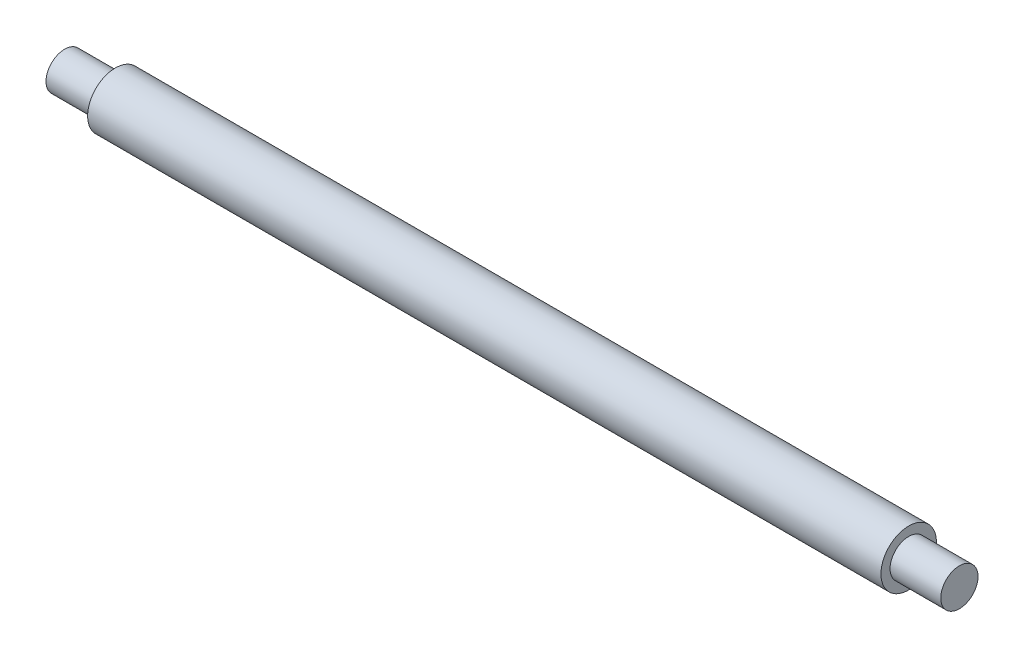
ISO-10303-21;
HEADER;
FILE_DESCRIPTION(('STEP AP214'),'2;1');
FILE_NAME('part.step','',(''),(''),'','','');
FILE_SCHEMA(('AUTOMOTIVE_DESIGN { 1 0 10303 214 1 1 1 1 }'));
ENDSEC;
DATA;
#1=APPLICATION_CONTEXT('core data for automotive mechanical design processes');
#2=APPLICATION_PROTOCOL_DEFINITION('international standard','automotive_design',2000,#1);
#3=PRODUCT_CONTEXT('',#1,'mechanical');
#4=PRODUCT('Part','Part','',(#3));
#5=PRODUCT_RELATED_PRODUCT_CATEGORY('part','',(#4));
#6=PRODUCT_DEFINITION_FORMATION('','',#4);
#7=PRODUCT_DEFINITION_CONTEXT('part definition',#1,'design');
#8=PRODUCT_DEFINITION('design','',#6,#7);
#9=PRODUCT_DEFINITION_SHAPE('','',#8);
#10=(LENGTH_UNIT() NAMED_UNIT(*) SI_UNIT(.MILLI.,.METRE.));
#11=(NAMED_UNIT(*) PLANE_ANGLE_UNIT() SI_UNIT($,.RADIAN.));
#12=(NAMED_UNIT(*) SI_UNIT($,.STERADIAN.) SOLID_ANGLE_UNIT());
#13=UNCERTAINTY_MEASURE_WITH_UNIT(LENGTH_MEASURE(1.E-05),#10,'distance_accuracy_value','');
#14=(GEOMETRIC_REPRESENTATION_CONTEXT(3) GLOBAL_UNCERTAINTY_ASSIGNED_CONTEXT((#13)) GLOBAL_UNIT_ASSIGNED_CONTEXT((#10,
#11,#12)) REPRESENTATION_CONTEXT('',''));
#15=CARTESIAN_POINT('',(0.,0.,0.));
#16=DIRECTION('',(0.,0.,1.));
#17=DIRECTION('',(1.,0.,0.));
#18=AXIS2_PLACEMENT_3D('',#15,#16,#17);
#19=CARTESIAN_POINT('',(76.2,0.,0.));
#20=DIRECTION('',(-1.,0.,0.));
#21=DIRECTION('',(0.,0.,1.));
#22=AXIS2_PLACEMENT_3D('',#19,#20,#21);
#23=PLANE('',#22);
#24=CARTESIAN_POINT('',(76.2,0.,0.));
#25=DIRECTION('',(-1.,0.,0.));
#26=DIRECTION('',(0.,0.,1.));
#27=AXIS2_PLACEMENT_3D('',#24,#25,#26);
#28=CIRCLE('',#27,3.17500000000001);
#29=CARTESIAN_POINT('',(76.2,0.,3.17500000000001));
#30=VERTEX_POINT('',#29);
#31=EDGE_CURVE('E12',#30,#30,#28,.T.);
#32=ORIENTED_EDGE('',*,*,#31,.F.);
#33=EDGE_LOOP('',(#32));
#34=FACE_BOUND('',#33,.T.);
#35=ADVANCED_FACE('F44',(#34),#23,.F.);
#36=CARTESIAN_POINT('',(-76.2,0.,0.));
#37=DIRECTION('',(-1.,0.,0.));
#38=DIRECTION('',(0.,0.,1.));
#39=AXIS2_PLACEMENT_3D('',#36,#37,#38);
#40=CYLINDRICAL_SURFACE('',#39,3.175);
#41=CARTESIAN_POINT('',(67.564,0.,0.));
#42=DIRECTION('',(-1.,0.,0.));
#43=DIRECTION('',(0.,0.,1.));
#44=AXIS2_PLACEMENT_3D('',#41,#42,#43);
#45=CIRCLE('',#44,3.175);
#46=CARTESIAN_POINT('',(67.564,0.,3.175));
#47=VERTEX_POINT('',#46);
#48=EDGE_CURVE('E50',#47,#47,#45,.T.);
#49=ORIENTED_EDGE('',*,*,#48,.F.);
#50=EDGE_LOOP('',(#49));
#51=FACE_BOUND('',#50,.T.);
#52=ORIENTED_EDGE('',*,*,#31,.T.);
#53=EDGE_LOOP('',(#52));
#54=FACE_BOUND('',#53,.T.);
#55=ADVANCED_FACE('F92',(#51,#54),#40,.T.);
#56=CARTESIAN_POINT('',(67.564,3.175,0.));
#57=DIRECTION('',(-1.,0.,0.));
#58=DIRECTION('',(0.,0.,1.));
#59=AXIS2_PLACEMENT_3D('',#56,#57,#58);
#60=PLANE('',#59);
#61=CARTESIAN_POINT('',(67.564,0.,0.));
#62=DIRECTION('',(-1.,0.,0.));
#63=DIRECTION('',(0.,0.,1.));
#64=AXIS2_PLACEMENT_3D('',#61,#62,#63);
#65=CIRCLE('',#64,4.72439999999999);
#66=CARTESIAN_POINT('',(67.564,0.,4.72439999999999));
#67=VERTEX_POINT('',#66);
#68=EDGE_CURVE('E54',#67,#67,#65,.T.);
#69=ORIENTED_EDGE('',*,*,#68,.F.);
#70=EDGE_LOOP('',(#69));
#71=FACE_BOUND('',#70,.T.);
#72=ORIENTED_EDGE('',*,*,#48,.T.);
#73=EDGE_LOOP('',(#72));
#74=FACE_BOUND('',#73,.T.);
#75=ADVANCED_FACE('F87',(#71,#74),#60,.F.);
#76=CARTESIAN_POINT('',(-76.2,0.,0.));
#77=DIRECTION('',(-1.,0.,0.));
#78=DIRECTION('',(0.,0.,1.));
#79=AXIS2_PLACEMENT_3D('',#76,#77,#78);
#80=CYLINDRICAL_SURFACE('',#79,4.72439999999999);
#81=CARTESIAN_POINT('',(-67.564,0.,0.));
#82=DIRECTION('',(-1.,0.,0.));
#83=DIRECTION('',(0.,0.,1.));
#84=AXIS2_PLACEMENT_3D('',#81,#82,#83);
#85=CIRCLE('',#84,4.72439999999999);
#86=CARTESIAN_POINT('',(-67.564,0.,4.72439999999999));
#87=VERTEX_POINT('',#86);
#88=EDGE_CURVE('E58',#87,#87,#85,.T.);
#89=ORIENTED_EDGE('',*,*,#88,.F.);
#90=EDGE_LOOP('',(#89));
#91=FACE_BOUND('',#90,.T.);
#92=ORIENTED_EDGE('',*,*,#68,.T.);
#93=EDGE_LOOP('',(#92));
#94=FACE_BOUND('',#93,.T.);
#95=ADVANCED_FACE('F81',(#91,#94),#80,.T.);
#96=CARTESIAN_POINT('',(-67.564,3.175,0.));
#97=DIRECTION('',(1.,0.,0.));
#98=DIRECTION('',(0.,0.,-1.));
#99=AXIS2_PLACEMENT_3D('',#96,#97,#98);
#100=PLANE('',#99);
#101=CARTESIAN_POINT('',(-67.564,0.,0.));
#102=DIRECTION('',(-1.,0.,0.));
#103=DIRECTION('',(0.,0.,1.));
#104=AXIS2_PLACEMENT_3D('',#101,#102,#103);
#105=CIRCLE('',#104,3.175);
#106=CARTESIAN_POINT('',(-67.564,0.,3.175));
#107=VERTEX_POINT('',#106);
#108=EDGE_CURVE('E63',#107,#107,#105,.T.);
#109=ORIENTED_EDGE('',*,*,#108,.F.);
#110=EDGE_LOOP('',(#109));
#111=FACE_BOUND('',#110,.T.);
#112=ORIENTED_EDGE('',*,*,#88,.T.);
#113=EDGE_LOOP('',(#112));
#114=FACE_BOUND('',#113,.T.);
#115=ADVANCED_FACE('F75',(#111,#114),#100,.F.);
#116=CARTESIAN_POINT('',(-76.2,0.,0.));
#117=DIRECTION('',(-1.,0.,0.));
#118=DIRECTION('',(0.,0.,1.));
#119=AXIS2_PLACEMENT_3D('',#116,#117,#118);
#120=CYLINDRICAL_SURFACE('',#119,3.175);
#121=CARTESIAN_POINT('',(-76.2,0.,0.));
#122=DIRECTION('',(-1.,0.,0.));
#123=DIRECTION('',(0.,0.,1.));
#124=AXIS2_PLACEMENT_3D('',#121,#122,#123);
#125=CIRCLE('',#124,3.17500000000001);
#126=CARTESIAN_POINT('',(-76.2,0.,3.17500000000001));
#127=VERTEX_POINT('',#126);
#128=EDGE_CURVE('E66',#127,#127,#125,.T.);
#129=ORIENTED_EDGE('',*,*,#128,.F.);
#130=EDGE_LOOP('',(#129));
#131=FACE_BOUND('',#130,.T.);
#132=ORIENTED_EDGE('',*,*,#108,.T.);
#133=EDGE_LOOP('',(#132));
#134=FACE_BOUND('',#133,.T.);
#135=ADVANCED_FACE('F72',(#131,#134),#120,.T.);
#136=CARTESIAN_POINT('',(-76.2,0.,0.));
#137=DIRECTION('',(1.,0.,0.));
#138=DIRECTION('',(0.,0.,-1.));
#139=AXIS2_PLACEMENT_3D('',#136,#137,#138);
#140=PLANE('',#139);
#141=ORIENTED_EDGE('',*,*,#128,.T.);
#142=EDGE_LOOP('',(#141));
#143=FACE_BOUND('',#142,.T.);
#144=ADVANCED_FACE('F70',(#143),#140,.F.);
#145=CLOSED_SHELL('',(#35,#55,#75,#95,#115,#135,#144));
#146=MANIFOLD_SOLID_BREP('B2',#145);
#147=ADVANCED_BREP_SHAPE_REPRESENTATION('',(#18,#146),#14);
#148=SHAPE_DEFINITION_REPRESENTATION(#9,#147);
ENDSEC;
END-ISO-10303-21;
